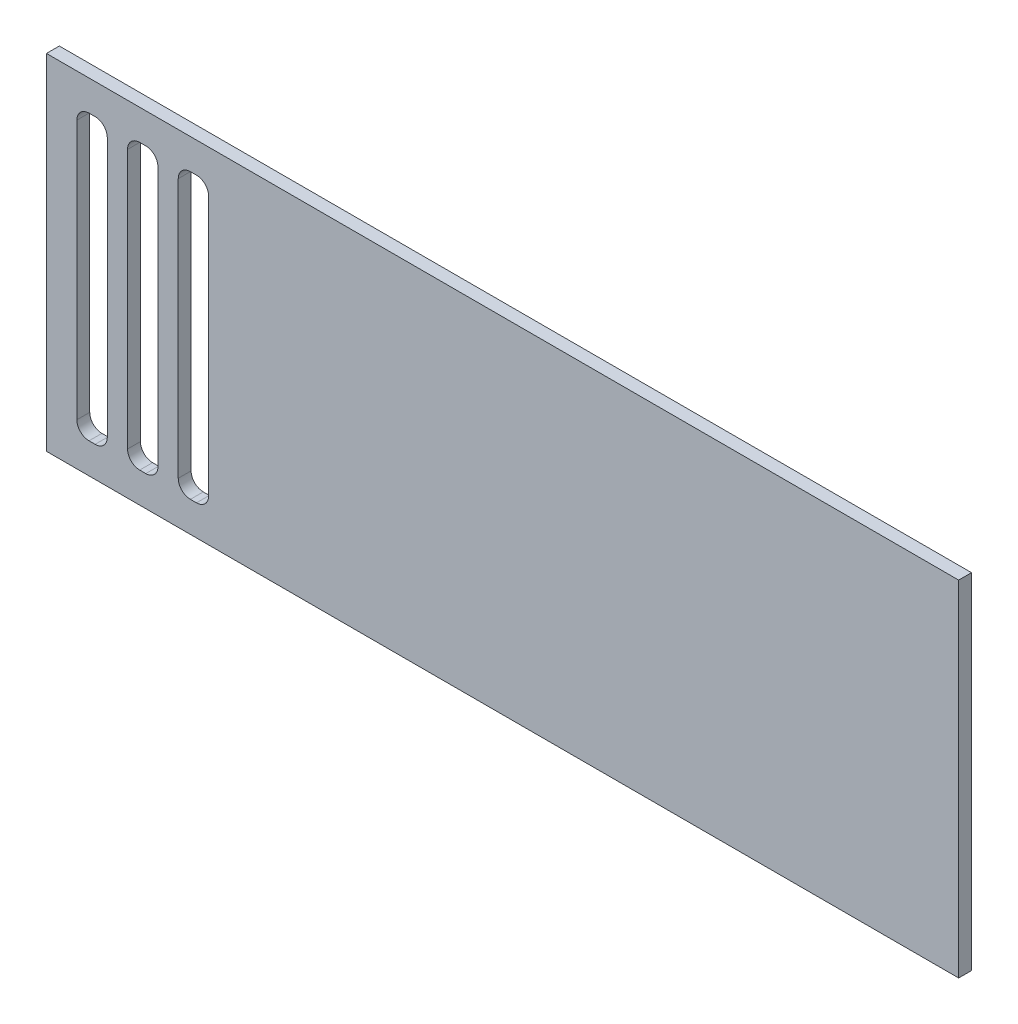
ISO-10303-21;
HEADER;
FILE_DESCRIPTION(('STEP AP214'),'2;1');
FILE_NAME('part.step','',(''),(''),'','','');
FILE_SCHEMA(('AUTOMOTIVE_DESIGN { 1 0 10303 214 1 1 1 1 }'));
ENDSEC;
DATA;
#1=APPLICATION_CONTEXT('core data for automotive mechanical design processes');
#2=APPLICATION_PROTOCOL_DEFINITION('international standard','automotive_design',2000,#1);
#3=PRODUCT_CONTEXT('',#1,'mechanical');
#4=PRODUCT('Part','Part','',(#3));
#5=PRODUCT_RELATED_PRODUCT_CATEGORY('part','',(#4));
#6=PRODUCT_DEFINITION_FORMATION('','',#4);
#7=PRODUCT_DEFINITION_CONTEXT('part definition',#1,'design');
#8=PRODUCT_DEFINITION('design','',#6,#7);
#9=PRODUCT_DEFINITION_SHAPE('','',#8);
#10=(LENGTH_UNIT() NAMED_UNIT(*) SI_UNIT(.MILLI.,.METRE.));
#11=(NAMED_UNIT(*) PLANE_ANGLE_UNIT() SI_UNIT($,.RADIAN.));
#12=(NAMED_UNIT(*) SI_UNIT($,.STERADIAN.) SOLID_ANGLE_UNIT());
#13=UNCERTAINTY_MEASURE_WITH_UNIT(LENGTH_MEASURE(1.E-05),#10,'distance_accuracy_value','');
#14=(GEOMETRIC_REPRESENTATION_CONTEXT(3) GLOBAL_UNCERTAINTY_ASSIGNED_CONTEXT((#13)) GLOBAL_UNIT_ASSIGNED_CONTEXT((#10,
#11,#12)) REPRESENTATION_CONTEXT('',''));
#15=CARTESIAN_POINT('',(0.,0.,0.));
#16=DIRECTION('',(0.,0.,1.));
#17=DIRECTION('',(1.,0.,0.));
#18=AXIS2_PLACEMENT_3D('',#15,#16,#17);
#19=CARTESIAN_POINT('',(0.,0.,6.35));
#20=DIRECTION('',(1.,0.,0.));
#21=DIRECTION('',(0.,0.,-1.));
#22=AXIS2_PLACEMENT_3D('',#19,#20,#21);
#23=PLANE('',#22);
#24=DIRECTION('',(0.,-1.,0.));
#25=VECTOR('',#24,1.);
#26=CARTESIAN_POINT('',(0.,0.,0.));
#27=LINE('',#26,#25);
#28=CARTESIAN_POINT('',(0.,170.,0.));
#29=VERTEX_POINT('',#28);
#30=CARTESIAN_POINT('',(0.,0.,0.));
#31=VERTEX_POINT('',#30);
#32=EDGE_CURVE('E258',#29,#31,#27,.T.);
#33=ORIENTED_EDGE('',*,*,#32,.T.);
#34=DIRECTION('',(0.,0.,-1.));
#35=VECTOR('',#34,1.);
#36=CARTESIAN_POINT('',(0.,0.,6.35));
#37=LINE('',#36,#35);
#38=CARTESIAN_POINT('',(0.,0.,6.35));
#39=VERTEX_POINT('',#38);
#40=EDGE_CURVE('E237',#39,#31,#37,.T.);
#41=ORIENTED_EDGE('',*,*,#40,.F.);
#42=DIRECTION('',(0.,-1.,0.));
#43=VECTOR('',#42,1.);
#44=CARTESIAN_POINT('',(0.,0.,6.35));
#45=LINE('',#44,#43);
#46=CARTESIAN_POINT('',(0.,170.,6.35));
#47=VERTEX_POINT('',#46);
#48=EDGE_CURVE('E245',#47,#39,#45,.T.);
#49=ORIENTED_EDGE('',*,*,#48,.F.);
#50=DIRECTION('',(0.,0.,-1.));
#51=VECTOR('',#50,1.);
#52=CARTESIAN_POINT('',(0.,170.,6.35));
#53=LINE('',#52,#51);
#54=EDGE_CURVE('E487',#47,#29,#53,.T.);
#55=ORIENTED_EDGE('',*,*,#54,.T.);
#56=EDGE_LOOP('',(#33,#41,#49,#55));
#57=FACE_BOUND('',#56,.T.);
#58=ADVANCED_FACE('F48',(#57),#23,.F.);
#59=CARTESIAN_POINT('',(0.,0.,6.35));
#60=DIRECTION('',(0.,1.,0.));
#61=DIRECTION('',(0.,0.,1.));
#62=AXIS2_PLACEMENT_3D('',#59,#60,#61);
#63=PLANE('',#62);
#64=DIRECTION('',(1.,0.,0.));
#65=VECTOR('',#64,1.);
#66=CARTESIAN_POINT('',(0.,0.,0.));
#67=LINE('',#66,#65);
#68=CARTESIAN_POINT('',(450.,0.,0.));
#69=VERTEX_POINT('',#68);
#70=EDGE_CURVE('E490',#31,#69,#67,.T.);
#71=ORIENTED_EDGE('',*,*,#70,.T.);
#72=DIRECTION('',(0.,0.,-1.));
#73=VECTOR('',#72,1.);
#74=CARTESIAN_POINT('',(450.,0.,6.35));
#75=LINE('',#74,#73);
#76=CARTESIAN_POINT('',(450.,0.,6.35));
#77=VERTEX_POINT('',#76);
#78=EDGE_CURVE('E240',#77,#69,#75,.T.);
#79=ORIENTED_EDGE('',*,*,#78,.F.);
#80=DIRECTION('',(1.,0.,0.));
#81=VECTOR('',#80,1.);
#82=CARTESIAN_POINT('',(0.,0.,6.35));
#83=LINE('',#82,#81);
#84=EDGE_CURVE('E233',#39,#77,#83,.T.);
#85=ORIENTED_EDGE('',*,*,#84,.F.);
#86=ORIENTED_EDGE('',*,*,#40,.T.);
#87=EDGE_LOOP('',(#71,#79,#85,#86));
#88=FACE_BOUND('',#87,.T.);
#89=ADVANCED_FACE('F235',(#88),#63,.F.);
#90=CARTESIAN_POINT('',(450.,0.,6.35));
#91=DIRECTION('',(-1.,0.,0.));
#92=DIRECTION('',(0.,0.,1.));
#93=AXIS2_PLACEMENT_3D('',#90,#91,#92);
#94=PLANE('',#93);
#95=DIRECTION('',(0.,1.,0.));
#96=VECTOR('',#95,1.);
#97=CARTESIAN_POINT('',(450.,0.,0.));
#98=LINE('',#97,#96);
#99=CARTESIAN_POINT('',(450.,170.,0.));
#100=VERTEX_POINT('',#99);
#101=EDGE_CURVE('E493',#69,#100,#98,.T.);
#102=ORIENTED_EDGE('',*,*,#101,.T.);
#103=DIRECTION('',(0.,0.,-1.));
#104=VECTOR('',#103,1.);
#105=CARTESIAN_POINT('',(450.,170.,6.35));
#106=LINE('',#105,#104);
#107=CARTESIAN_POINT('',(450.,170.,6.35));
#108=VERTEX_POINT('',#107);
#109=EDGE_CURVE('E267',#108,#100,#106,.T.);
#110=ORIENTED_EDGE('',*,*,#109,.F.);
#111=DIRECTION('',(0.,1.,0.));
#112=VECTOR('',#111,1.);
#113=CARTESIAN_POINT('',(450.,0.,6.35));
#114=LINE('',#113,#112);
#115=EDGE_CURVE('E244',#77,#108,#114,.T.);
#116=ORIENTED_EDGE('',*,*,#115,.F.);
#117=ORIENTED_EDGE('',*,*,#78,.T.);
#118=EDGE_LOOP('',(#102,#110,#116,#117));
#119=FACE_BOUND('',#118,.T.);
#120=ADVANCED_FACE('F508',(#119),#94,.F.);
#121=CARTESIAN_POINT('',(0.,170.,6.35));
#122=DIRECTION('',(0.,-1.,0.));
#123=DIRECTION('',(0.,0.,-1.));
#124=AXIS2_PLACEMENT_3D('',#121,#122,#123);
#125=PLANE('',#124);
#126=DIRECTION('',(-1.,0.,0.));
#127=VECTOR('',#126,1.);
#128=CARTESIAN_POINT('',(0.,170.,0.));
#129=LINE('',#128,#127);
#130=EDGE_CURVE('E255',#100,#29,#129,.T.);
#131=ORIENTED_EDGE('',*,*,#130,.T.);
#132=ORIENTED_EDGE('',*,*,#54,.F.);
#133=DIRECTION('',(-1.,0.,0.));
#134=VECTOR('',#133,1.);
#135=CARTESIAN_POINT('',(0.,170.,6.35));
#136=LINE('',#135,#134);
#137=EDGE_CURVE('E250',#108,#47,#136,.T.);
#138=ORIENTED_EDGE('',*,*,#137,.F.);
#139=ORIENTED_EDGE('',*,*,#109,.T.);
#140=EDGE_LOOP('',(#131,#132,#138,#139));
#141=FACE_BOUND('',#140,.T.);
#142=ADVANCED_FACE('F504',(#141),#125,.F.);
#143=CARTESIAN_POINT('',(0.,0.,6.35));
#144=DIRECTION('',(0.,0.,-1.));
#145=DIRECTION('',(-1.,0.,0.));
#146=AXIS2_PLACEMENT_3D('',#143,#144,#145);
#147=PLANE('',#146);
#148=DIRECTION('',(-1.,0.,0.));
#149=VECTOR('',#148,1.);
#150=CARTESIAN_POINT('',(0.,15.,6.35));
#151=LINE('',#150,#149);
#152=CARTESIAN_POINT('',(24.,15.,6.35));
#153=VERTEX_POINT('',#152);
#154=CARTESIAN_POINT('',(21.,15.,6.35));
#155=VERTEX_POINT('',#154);
#156=EDGE_CURVE('E472',#153,#155,#151,.T.);
#157=ORIENTED_EDGE('',*,*,#156,.T.);
#158=CARTESIAN_POINT('',(21.,21.,6.35));
#159=DIRECTION('',(0.,0.,-1.));
#160=DIRECTION('',(-1.,0.,0.));
#161=AXIS2_PLACEMENT_3D('',#158,#159,#160);
#162=CIRCLE('',#161,6.);
#163=CARTESIAN_POINT('',(15.,21.,6.35));
#164=VERTEX_POINT('',#163);
#165=EDGE_CURVE('E57',#155,#164,#162,.T.);
#166=ORIENTED_EDGE('',*,*,#165,.T.);
#167=DIRECTION('',(0.,1.,0.));
#168=VECTOR('',#167,1.);
#169=CARTESIAN_POINT('',(15.,0.,6.35));
#170=LINE('',#169,#168);
#171=CARTESIAN_POINT('',(15.,149.,6.35));
#172=VERTEX_POINT('',#171);
#173=EDGE_CURVE('E469',#164,#172,#170,.T.);
#174=ORIENTED_EDGE('',*,*,#173,.T.);
#175=CARTESIAN_POINT('',(21.,149.,6.35));
#176=DIRECTION('',(0.,0.,-1.));
#177=DIRECTION('',(-1.,0.,0.));
#178=AXIS2_PLACEMENT_3D('',#175,#176,#177);
#179=CIRCLE('',#178,6.);
#180=CARTESIAN_POINT('',(21.,155.,6.35));
#181=VERTEX_POINT('',#180);
#182=EDGE_CURVE('E311',#172,#181,#179,.T.);
#183=ORIENTED_EDGE('',*,*,#182,.T.);
#184=DIRECTION('',(1.,0.,0.));
#185=VECTOR('',#184,1.);
#186=CARTESIAN_POINT('',(0.,155.,6.35));
#187=LINE('',#186,#185);
#188=CARTESIAN_POINT('',(24.,155.,6.35));
#189=VERTEX_POINT('',#188);
#190=EDGE_CURVE('E479',#181,#189,#187,.T.);
#191=ORIENTED_EDGE('',*,*,#190,.T.);
#192=CARTESIAN_POINT('',(24.,149.,6.35));
#193=DIRECTION('',(0.,0.,-1.));
#194=DIRECTION('',(-1.,0.,0.));
#195=AXIS2_PLACEMENT_3D('',#192,#193,#194);
#196=CIRCLE('',#195,6.);
#197=CARTESIAN_POINT('',(30.,149.,6.35));
#198=VERTEX_POINT('',#197);
#199=EDGE_CURVE('E329',#189,#198,#196,.T.);
#200=ORIENTED_EDGE('',*,*,#199,.T.);
#201=DIRECTION('',(0.,-1.,0.));
#202=VECTOR('',#201,1.);
#203=CARTESIAN_POINT('',(30.,0.,6.35));
#204=LINE('',#203,#202);
#205=CARTESIAN_POINT('',(30.,21.,6.35));
#206=VERTEX_POINT('',#205);
#207=EDGE_CURVE('E475',#198,#206,#204,.T.);
#208=ORIENTED_EDGE('',*,*,#207,.T.);
#209=CARTESIAN_POINT('',(24.,21.,6.35));
#210=DIRECTION('',(0.,0.,-1.));
#211=DIRECTION('',(-1.,0.,0.));
#212=AXIS2_PLACEMENT_3D('',#209,#210,#211);
#213=CIRCLE('',#212,6.);
#214=EDGE_CURVE('E388',#206,#153,#213,.T.);
#215=ORIENTED_EDGE('',*,*,#214,.T.);
#216=EDGE_LOOP('',(#157,#166,#174,#183,#191,#200,#208,#215));
#217=FACE_BOUND('',#216,.T.);
#218=DIRECTION('',(-1.,0.,0.));
#219=VECTOR('',#218,1.);
#220=CARTESIAN_POINT('',(0.,15.,6.35));
#221=LINE('',#220,#219);
#222=CARTESIAN_POINT('',(49.,15.,6.35));
#223=VERTEX_POINT('',#222);
#224=CARTESIAN_POINT('',(46.,15.,6.35));
#225=VERTEX_POINT('',#224);
#226=EDGE_CURVE('E446',#223,#225,#221,.T.);
#227=ORIENTED_EDGE('',*,*,#226,.T.);
#228=CARTESIAN_POINT('',(46.,21.,6.35));
#229=DIRECTION('',(0.,0.,-1.));
#230=DIRECTION('',(-1.,0.,0.));
#231=AXIS2_PLACEMENT_3D('',#228,#229,#230);
#232=CIRCLE('',#231,6.);
#233=CARTESIAN_POINT('',(40.,21.,6.35));
#234=VERTEX_POINT('',#233);
#235=EDGE_CURVE('E412',#225,#234,#232,.T.);
#236=ORIENTED_EDGE('',*,*,#235,.T.);
#237=DIRECTION('',(0.,1.,0.));
#238=VECTOR('',#237,1.);
#239=CARTESIAN_POINT('',(40.,0.,6.35));
#240=LINE('',#239,#238);
#241=CARTESIAN_POINT('',(40.,149.,6.35));
#242=VERTEX_POINT('',#241);
#243=EDGE_CURVE('E444',#234,#242,#240,.T.);
#244=ORIENTED_EDGE('',*,*,#243,.T.);
#245=CARTESIAN_POINT('',(46.,149.,6.35));
#246=DIRECTION('',(0.,0.,-1.));
#247=DIRECTION('',(-1.,0.,0.));
#248=AXIS2_PLACEMENT_3D('',#245,#246,#247);
#249=CIRCLE('',#248,6.);
#250=CARTESIAN_POINT('',(46.,155.,6.35));
#251=VERTEX_POINT('',#250);
#252=EDGE_CURVE('E317',#242,#251,#249,.T.);
#253=ORIENTED_EDGE('',*,*,#252,.T.);
#254=DIRECTION('',(1.,0.,0.));
#255=VECTOR('',#254,1.);
#256=CARTESIAN_POINT('',(0.,155.,6.35));
#257=LINE('',#256,#255);
#258=CARTESIAN_POINT('',(49.,155.,6.35));
#259=VERTEX_POINT('',#258);
#260=EDGE_CURVE('E465',#251,#259,#257,.T.);
#261=ORIENTED_EDGE('',*,*,#260,.T.);
#262=CARTESIAN_POINT('',(49.,149.,6.35));
#263=DIRECTION('',(0.,0.,-1.));
#264=DIRECTION('',(-1.,0.,0.));
#265=AXIS2_PLACEMENT_3D('',#262,#263,#264);
#266=CIRCLE('',#265,6.);
#267=CARTESIAN_POINT('',(55.,149.,6.35));
#268=VERTEX_POINT('',#267);
#269=EDGE_CURVE('E335',#259,#268,#266,.T.);
#270=ORIENTED_EDGE('',*,*,#269,.T.);
#271=DIRECTION('',(0.,-1.,0.));
#272=VECTOR('',#271,1.);
#273=CARTESIAN_POINT('',(55.,0.,6.35));
#274=LINE('',#273,#272);
#275=CARTESIAN_POINT('',(55.,21.,6.35));
#276=VERTEX_POINT('',#275);
#277=EDGE_CURVE('E455',#268,#276,#274,.T.);
#278=ORIENTED_EDGE('',*,*,#277,.T.);
#279=CARTESIAN_POINT('',(49.,21.,6.35));
#280=DIRECTION('',(0.,0.,-1.));
#281=DIRECTION('',(-1.,0.,0.));
#282=AXIS2_PLACEMENT_3D('',#279,#280,#281);
#283=CIRCLE('',#282,6.);
#284=EDGE_CURVE('E394',#276,#223,#283,.T.);
#285=ORIENTED_EDGE('',*,*,#284,.T.);
#286=EDGE_LOOP('',(#227,#236,#244,#253,#261,#270,#278,#285));
#287=FACE_BOUND('',#286,.T.);
#288=DIRECTION('',(-1.,0.,0.));
#289=VECTOR('',#288,1.);
#290=CARTESIAN_POINT('',(0.,15.,6.35));
#291=LINE('',#290,#289);
#292=CARTESIAN_POINT('',(74.,15.,6.35));
#293=VERTEX_POINT('',#292);
#294=CARTESIAN_POINT('',(71.,15.,6.35));
#295=VERTEX_POINT('',#294);
#296=EDGE_CURVE('E458',#293,#295,#291,.T.);
#297=ORIENTED_EDGE('',*,*,#296,.T.);
#298=CARTESIAN_POINT('',(71.,21.,6.35));
#299=DIRECTION('',(0.,0.,-1.));
#300=DIRECTION('',(-1.,0.,0.));
#301=AXIS2_PLACEMENT_3D('',#298,#299,#300);
#302=CIRCLE('',#301,6.);
#303=CARTESIAN_POINT('',(65.,21.,6.35));
#304=VERTEX_POINT('',#303);
#305=EDGE_CURVE('E406',#295,#304,#302,.T.);
#306=ORIENTED_EDGE('',*,*,#305,.T.);
#307=DIRECTION('',(0.,1.,0.));
#308=VECTOR('',#307,1.);
#309=CARTESIAN_POINT('',(65.,0.,6.35));
#310=LINE('',#309,#308);
#311=CARTESIAN_POINT('',(65.,149.,6.35));
#312=VERTEX_POINT('',#311);
#313=EDGE_CURVE('E618',#304,#312,#310,.T.);
#314=ORIENTED_EDGE('',*,*,#313,.T.);
#315=CARTESIAN_POINT('',(71.,149.,6.35));
#316=DIRECTION('',(0.,0.,-1.));
#317=DIRECTION('',(-1.,0.,0.));
#318=AXIS2_PLACEMENT_3D('',#315,#316,#317);
#319=CIRCLE('',#318,6.);
#320=CARTESIAN_POINT('',(71.,155.,6.35));
#321=VERTEX_POINT('',#320);
#322=EDGE_CURVE('E323',#312,#321,#319,.T.);
#323=ORIENTED_EDGE('',*,*,#322,.T.);
#324=DIRECTION('',(1.,0.,0.));
#325=VECTOR('',#324,1.);
#326=CARTESIAN_POINT('',(0.,155.,6.35));
#327=LINE('',#326,#325);
#328=CARTESIAN_POINT('',(74.,155.,6.35));
#329=VERTEX_POINT('',#328);
#330=EDGE_CURVE('E586',#321,#329,#327,.T.);
#331=ORIENTED_EDGE('',*,*,#330,.T.);
#332=CARTESIAN_POINT('',(74.,149.,6.35));
#333=DIRECTION('',(0.,0.,-1.));
#334=DIRECTION('',(-1.,0.,0.));
#335=AXIS2_PLACEMENT_3D('',#332,#333,#334);
#336=CIRCLE('',#335,6.);
#337=CARTESIAN_POINT('',(80.,149.,6.35));
#338=VERTEX_POINT('',#337);
#339=EDGE_CURVE('E341',#329,#338,#336,.T.);
#340=ORIENTED_EDGE('',*,*,#339,.T.);
#341=DIRECTION('',(0.,-1.,0.));
#342=VECTOR('',#341,1.);
#343=CARTESIAN_POINT('',(80.,0.,6.35));
#344=LINE('',#343,#342);
#345=CARTESIAN_POINT('',(80.,21.,6.35));
#346=VERTEX_POINT('',#345);
#347=EDGE_CURVE('E451',#338,#346,#344,.T.);
#348=ORIENTED_EDGE('',*,*,#347,.T.);
#349=CARTESIAN_POINT('',(74.,21.,6.35));
#350=DIRECTION('',(0.,0.,-1.));
#351=DIRECTION('',(-1.,0.,0.));
#352=AXIS2_PLACEMENT_3D('',#349,#350,#351);
#353=CIRCLE('',#352,6.);
#354=EDGE_CURVE('E400',#346,#293,#353,.T.);
#355=ORIENTED_EDGE('',*,*,#354,.T.);
#356=EDGE_LOOP('',(#297,#306,#314,#323,#331,#340,#348,#355));
#357=FACE_BOUND('',#356,.T.);
#358=ORIENTED_EDGE('',*,*,#48,.T.);
#359=ORIENTED_EDGE('',*,*,#84,.T.);
#360=ORIENTED_EDGE('',*,*,#115,.T.);
#361=ORIENTED_EDGE('',*,*,#137,.T.);
#362=EDGE_LOOP('',(#358,#359,#360,#361));
#363=FACE_BOUND('',#362,.T.);
#364=ADVANCED_FACE('F248',(#217,#287,#357,#363),#147,.F.);
#365=CARTESIAN_POINT('',(0.,0.,0.));
#366=DIRECTION('',(0.,0.,-1.));
#367=DIRECTION('',(-1.,0.,0.));
#368=AXIS2_PLACEMENT_3D('',#365,#366,#367);
#369=PLANE('',#368);
#370=DIRECTION('',(1.,0.,0.));
#371=VECTOR('',#370,1.);
#372=CARTESIAN_POINT('',(30.,15.,0.));
#373=LINE('',#372,#371);
#374=CARTESIAN_POINT('',(21.,15.,0.));
#375=VERTEX_POINT('',#374);
#376=CARTESIAN_POINT('',(24.,15.,0.));
#377=VERTEX_POINT('',#376);
#378=EDGE_CURVE('E574',#375,#377,#373,.T.);
#379=ORIENTED_EDGE('',*,*,#378,.T.);
#380=CARTESIAN_POINT('',(24.,21.,0.));
#381=DIRECTION('',(0.,0.,-1.));
#382=DIRECTION('',(-1.,0.,0.));
#383=AXIS2_PLACEMENT_3D('',#380,#381,#382);
#384=CIRCLE('',#383,6.);
#385=CARTESIAN_POINT('',(30.,21.,0.));
#386=VERTEX_POINT('',#385);
#387=EDGE_CURVE('E391',#377,#386,#384,.F.);
#388=ORIENTED_EDGE('',*,*,#387,.T.);
#389=DIRECTION('',(0.,1.,0.));
#390=VECTOR('',#389,1.);
#391=CARTESIAN_POINT('',(30.,155.,0.));
#392=LINE('',#391,#390);
#393=CARTESIAN_POINT('',(30.,149.,0.));
#394=VERTEX_POINT('',#393);
#395=EDGE_CURVE('E582',#386,#394,#392,.T.);
#396=ORIENTED_EDGE('',*,*,#395,.T.);
#397=CARTESIAN_POINT('',(24.,149.,0.));
#398=DIRECTION('',(0.,0.,-1.));
#399=DIRECTION('',(-1.,0.,0.));
#400=AXIS2_PLACEMENT_3D('',#397,#398,#399);
#401=CIRCLE('',#400,6.);
#402=CARTESIAN_POINT('',(24.,155.,0.));
#403=VERTEX_POINT('',#402);
#404=EDGE_CURVE('E332',#394,#403,#401,.F.);
#405=ORIENTED_EDGE('',*,*,#404,.T.);
#406=DIRECTION('',(-1.,0.,0.));
#407=VECTOR('',#406,1.);
#408=CARTESIAN_POINT('',(15.,155.,0.));
#409=LINE('',#408,#407);
#410=CARTESIAN_POINT('',(21.,155.,0.));
#411=VERTEX_POINT('',#410);
#412=EDGE_CURVE('E588',#403,#411,#409,.T.);
#413=ORIENTED_EDGE('',*,*,#412,.T.);
#414=CARTESIAN_POINT('',(21.,149.,0.));
#415=DIRECTION('',(0.,0.,-1.));
#416=DIRECTION('',(-1.,0.,0.));
#417=AXIS2_PLACEMENT_3D('',#414,#415,#416);
#418=CIRCLE('',#417,6.);
#419=CARTESIAN_POINT('',(15.,149.,0.));
#420=VERTEX_POINT('',#419);
#421=EDGE_CURVE('E314',#411,#420,#418,.F.);
#422=ORIENTED_EDGE('',*,*,#421,.T.);
#423=DIRECTION('',(0.,-1.,0.));
#424=VECTOR('',#423,1.);
#425=CARTESIAN_POINT('',(15.,15.,0.));
#426=LINE('',#425,#424);
#427=CARTESIAN_POINT('',(15.,21.,0.));
#428=VERTEX_POINT('',#427);
#429=EDGE_CURVE('E576',#420,#428,#426,.T.);
#430=ORIENTED_EDGE('',*,*,#429,.T.);
#431=CARTESIAN_POINT('',(21.,21.,0.));
#432=DIRECTION('',(0.,0.,-1.));
#433=DIRECTION('',(-1.,0.,0.));
#434=AXIS2_PLACEMENT_3D('',#431,#432,#433);
#435=CIRCLE('',#434,6.);
#436=EDGE_CURVE('E11',#428,#375,#435,.F.);
#437=ORIENTED_EDGE('',*,*,#436,.T.);
#438=EDGE_LOOP('',(#379,#388,#396,#405,#413,#422,#430,#437));
#439=FACE_BOUND('',#438,.T.);
#440=DIRECTION('',(1.,0.,0.));
#441=VECTOR('',#440,1.);
#442=CARTESIAN_POINT('',(55.,15.,0.));
#443=LINE('',#442,#441);
#444=CARTESIAN_POINT('',(46.,15.,0.));
#445=VERTEX_POINT('',#444);
#446=CARTESIAN_POINT('',(49.,15.,0.));
#447=VERTEX_POINT('',#446);
#448=EDGE_CURVE('E425',#445,#447,#443,.T.);
#449=ORIENTED_EDGE('',*,*,#448,.T.);
#450=CARTESIAN_POINT('',(49.,21.,0.));
#451=DIRECTION('',(0.,0.,-1.));
#452=DIRECTION('',(-1.,0.,0.));
#453=AXIS2_PLACEMENT_3D('',#450,#451,#452);
#454=CIRCLE('',#453,6.);
#455=CARTESIAN_POINT('',(55.,21.,0.));
#456=VERTEX_POINT('',#455);
#457=EDGE_CURVE('E397',#447,#456,#454,.F.);
#458=ORIENTED_EDGE('',*,*,#457,.T.);
#459=DIRECTION('',(0.,1.,0.));
#460=VECTOR('',#459,1.);
#461=CARTESIAN_POINT('',(55.,155.,0.));
#462=LINE('',#461,#460);
#463=CARTESIAN_POINT('',(55.,149.,0.));
#464=VERTEX_POINT('',#463);
#465=EDGE_CURVE('E438',#456,#464,#462,.T.);
#466=ORIENTED_EDGE('',*,*,#465,.T.);
#467=CARTESIAN_POINT('',(49.,149.,0.));
#468=DIRECTION('',(0.,0.,-1.));
#469=DIRECTION('',(-1.,0.,0.));
#470=AXIS2_PLACEMENT_3D('',#467,#468,#469);
#471=CIRCLE('',#470,6.);
#472=CARTESIAN_POINT('',(49.,155.,0.));
#473=VERTEX_POINT('',#472);
#474=EDGE_CURVE('E338',#464,#473,#471,.F.);
#475=ORIENTED_EDGE('',*,*,#474,.T.);
#476=DIRECTION('',(-1.,0.,0.));
#477=VECTOR('',#476,1.);
#478=CARTESIAN_POINT('',(40.,155.,0.));
#479=LINE('',#478,#477);
#480=CARTESIAN_POINT('',(46.,155.,0.));
#481=VERTEX_POINT('',#480);
#482=EDGE_CURVE('E597',#473,#481,#479,.T.);
#483=ORIENTED_EDGE('',*,*,#482,.T.);
#484=CARTESIAN_POINT('',(46.,149.,0.));
#485=DIRECTION('',(0.,0.,-1.));
#486=DIRECTION('',(-1.,0.,0.));
#487=AXIS2_PLACEMENT_3D('',#484,#485,#486);
#488=CIRCLE('',#487,6.);
#489=CARTESIAN_POINT('',(40.,149.,0.));
#490=VERTEX_POINT('',#489);
#491=EDGE_CURVE('E320',#481,#490,#488,.F.);
#492=ORIENTED_EDGE('',*,*,#491,.T.);
#493=DIRECTION('',(0.,-1.,0.));
#494=VECTOR('',#493,1.);
#495=CARTESIAN_POINT('',(40.,15.,0.));
#496=LINE('',#495,#494);
#497=CARTESIAN_POINT('',(40.,21.,0.));
#498=VERTEX_POINT('',#497);
#499=EDGE_CURVE('E428',#490,#498,#496,.T.);
#500=ORIENTED_EDGE('',*,*,#499,.T.);
#501=CARTESIAN_POINT('',(46.,21.,0.));
#502=DIRECTION('',(0.,0.,-1.));
#503=DIRECTION('',(-1.,0.,0.));
#504=AXIS2_PLACEMENT_3D('',#501,#502,#503);
#505=CIRCLE('',#504,6.);
#506=EDGE_CURVE('E415',#498,#445,#505,.F.);
#507=ORIENTED_EDGE('',*,*,#506,.T.);
#508=EDGE_LOOP('',(#449,#458,#466,#475,#483,#492,#500,#507));
#509=FACE_BOUND('',#508,.T.);
#510=DIRECTION('',(1.,0.,0.));
#511=VECTOR('',#510,1.);
#512=CARTESIAN_POINT('',(65.,15.,0.));
#513=LINE('',#512,#511);
#514=CARTESIAN_POINT('',(71.,15.,0.));
#515=VERTEX_POINT('',#514);
#516=CARTESIAN_POINT('',(74.,15.,0.));
#517=VERTEX_POINT('',#516);
#518=EDGE_CURVE('E601',#515,#517,#513,.T.);
#519=ORIENTED_EDGE('',*,*,#518,.T.);
#520=CARTESIAN_POINT('',(74.,21.,0.));
#521=DIRECTION('',(0.,0.,-1.));
#522=DIRECTION('',(-1.,0.,0.));
#523=AXIS2_PLACEMENT_3D('',#520,#521,#522);
#524=CIRCLE('',#523,6.);
#525=CARTESIAN_POINT('',(80.,21.,0.));
#526=VERTEX_POINT('',#525);
#527=EDGE_CURVE('E403',#517,#526,#524,.F.);
#528=ORIENTED_EDGE('',*,*,#527,.T.);
#529=DIRECTION('',(0.,1.,0.));
#530=VECTOR('',#529,1.);
#531=CARTESIAN_POINT('',(80.,15.,0.));
#532=LINE('',#531,#530);
#533=CARTESIAN_POINT('',(80.,149.,0.));
#534=VERTEX_POINT('',#533);
#535=EDGE_CURVE('E593',#526,#534,#532,.T.);
#536=ORIENTED_EDGE('',*,*,#535,.T.);
#537=CARTESIAN_POINT('',(74.,149.,0.));
#538=DIRECTION('',(0.,0.,-1.));
#539=DIRECTION('',(-1.,0.,0.));
#540=AXIS2_PLACEMENT_3D('',#537,#538,#539);
#541=CIRCLE('',#540,6.);
#542=CARTESIAN_POINT('',(74.,155.,0.));
#543=VERTEX_POINT('',#542);
#544=EDGE_CURVE('E344',#534,#543,#541,.F.);
#545=ORIENTED_EDGE('',*,*,#544,.T.);
#546=DIRECTION('',(-1.,0.,0.));
#547=VECTOR('',#546,1.);
#548=CARTESIAN_POINT('',(80.,155.,0.));
#549=LINE('',#548,#547);
#550=CARTESIAN_POINT('',(71.,155.,0.));
#551=VERTEX_POINT('',#550);
#552=EDGE_CURVE('E609',#543,#551,#549,.T.);
#553=ORIENTED_EDGE('',*,*,#552,.T.);
#554=CARTESIAN_POINT('',(71.,149.,0.));
#555=DIRECTION('',(0.,0.,-1.));
#556=DIRECTION('',(-1.,0.,0.));
#557=AXIS2_PLACEMENT_3D('',#554,#555,#556);
#558=CIRCLE('',#557,6.);
#559=CARTESIAN_POINT('',(65.,149.,0.));
#560=VERTEX_POINT('',#559);
#561=EDGE_CURVE('E326',#551,#560,#558,.F.);
#562=ORIENTED_EDGE('',*,*,#561,.T.);
#563=DIRECTION('',(0.,-1.,0.));
#564=VECTOR('',#563,1.);
#565=CARTESIAN_POINT('',(65.,155.,0.));
#566=LINE('',#565,#564);
#567=CARTESIAN_POINT('',(65.,21.,0.));
#568=VERTEX_POINT('',#567);
#569=EDGE_CURVE('E605',#560,#568,#566,.T.);
#570=ORIENTED_EDGE('',*,*,#569,.T.);
#571=CARTESIAN_POINT('',(71.,21.,0.));
#572=DIRECTION('',(0.,0.,-1.));
#573=DIRECTION('',(-1.,0.,0.));
#574=AXIS2_PLACEMENT_3D('',#571,#572,#573);
#575=CIRCLE('',#574,6.);
#576=EDGE_CURVE('E409',#568,#515,#575,.F.);
#577=ORIENTED_EDGE('',*,*,#576,.T.);
#578=EDGE_LOOP('',(#519,#528,#536,#545,#553,#562,#570,#577));
#579=FACE_BOUND('',#578,.T.);
#580=ORIENTED_EDGE('',*,*,#32,.F.);
#581=ORIENTED_EDGE('',*,*,#130,.F.);
#582=ORIENTED_EDGE('',*,*,#101,.F.);
#583=ORIENTED_EDGE('',*,*,#70,.F.);
#584=EDGE_LOOP('',(#580,#581,#582,#583));
#585=FACE_BOUND('',#584,.T.);
#586=ADVANCED_FACE('F423',(#439,#509,#579,#585),#369,.T.);
#587=CARTESIAN_POINT('',(80.,15.,0.));
#588=DIRECTION('',(1.,0.,0.));
#589=DIRECTION('',(0.,0.,-1.));
#590=AXIS2_PLACEMENT_3D('',#587,#588,#589);
#591=PLANE('',#590);
#592=ORIENTED_EDGE('',*,*,#535,.F.);
#593=DIRECTION('',(0.,0.,1.));
#594=VECTOR('',#593,1.);
#595=CARTESIAN_POINT('',(80.,21.,6.35));
#596=LINE('',#595,#594);
#597=EDGE_CURVE('E369',#526,#346,#596,.T.);
#598=ORIENTED_EDGE('',*,*,#597,.T.);
#599=ORIENTED_EDGE('',*,*,#347,.F.);
#600=DIRECTION('',(0.,0.,1.));
#601=VECTOR('',#600,1.);
#602=CARTESIAN_POINT('',(80.,149.,0.));
#603=LINE('',#602,#601);
#604=EDGE_CURVE('E307',#338,#534,#603,.F.);
#605=ORIENTED_EDGE('',*,*,#604,.T.);
#606=EDGE_LOOP('',(#592,#598,#599,#605));
#607=FACE_BOUND('',#606,.T.);
#608=ADVANCED_FACE('F633',(#607),#591,.F.);
#609=CARTESIAN_POINT('',(65.,15.,0.));
#610=DIRECTION('',(0.,-1.,0.));
#611=DIRECTION('',(0.,0.,-1.));
#612=AXIS2_PLACEMENT_3D('',#609,#610,#611);
#613=PLANE('',#612);
#614=ORIENTED_EDGE('',*,*,#296,.F.);
#615=DIRECTION('',(0.,0.,1.));
#616=VECTOR('',#615,1.);
#617=CARTESIAN_POINT('',(74.,15.,0.));
#618=LINE('',#617,#616);
#619=EDGE_CURVE('E377',#293,#517,#618,.F.);
#620=ORIENTED_EDGE('',*,*,#619,.T.);
#621=ORIENTED_EDGE('',*,*,#518,.F.);
#622=DIRECTION('',(0.,0.,1.));
#623=VECTOR('',#622,1.);
#624=CARTESIAN_POINT('',(71.,15.,6.35));
#625=LINE('',#624,#623);
#626=EDGE_CURVE('E373',#515,#295,#625,.T.);
#627=ORIENTED_EDGE('',*,*,#626,.T.);
#628=EDGE_LOOP('',(#614,#620,#621,#627));
#629=FACE_BOUND('',#628,.T.);
#630=ADVANCED_FACE('F626',(#629),#613,.F.);
#631=CARTESIAN_POINT('',(65.,155.,0.));
#632=DIRECTION('',(-1.,0.,0.));
#633=DIRECTION('',(0.,0.,1.));
#634=AXIS2_PLACEMENT_3D('',#631,#632,#633);
#635=PLANE('',#634);
#636=ORIENTED_EDGE('',*,*,#313,.F.);
#637=DIRECTION('',(0.,0.,1.));
#638=VECTOR('',#637,1.);
#639=CARTESIAN_POINT('',(65.,21.,0.));
#640=LINE('',#639,#638);
#641=EDGE_CURVE('E380',#304,#568,#640,.F.);
#642=ORIENTED_EDGE('',*,*,#641,.T.);
#643=ORIENTED_EDGE('',*,*,#569,.F.);
#644=DIRECTION('',(0.,0.,1.));
#645=VECTOR('',#644,1.);
#646=CARTESIAN_POINT('',(65.,149.,6.35));
#647=LINE('',#646,#645);
#648=EDGE_CURVE('E288',#560,#312,#647,.T.);
#649=ORIENTED_EDGE('',*,*,#648,.T.);
#650=EDGE_LOOP('',(#636,#642,#643,#649));
#651=FACE_BOUND('',#650,.T.);
#652=ADVANCED_FACE('F649',(#651),#635,.F.);
#653=CARTESIAN_POINT('',(80.,155.,0.));
#654=DIRECTION('',(0.,1.,0.));
#655=DIRECTION('',(0.,0.,1.));
#656=AXIS2_PLACEMENT_3D('',#653,#654,#655);
#657=PLANE('',#656);
#658=ORIENTED_EDGE('',*,*,#330,.F.);
#659=DIRECTION('',(0.,0.,1.));
#660=VECTOR('',#659,1.);
#661=CARTESIAN_POINT('',(71.,155.,0.));
#662=LINE('',#661,#660);
#663=EDGE_CURVE('E296',#321,#551,#662,.F.);
#664=ORIENTED_EDGE('',*,*,#663,.T.);
#665=ORIENTED_EDGE('',*,*,#552,.F.);
#666=DIRECTION('',(0.,0.,1.));
#667=VECTOR('',#666,1.);
#668=CARTESIAN_POINT('',(74.,155.,6.35));
#669=LINE('',#668,#667);
#670=EDGE_CURVE('E292',#543,#329,#669,.T.);
#671=ORIENTED_EDGE('',*,*,#670,.T.);
#672=EDGE_LOOP('',(#658,#664,#665,#671));
#673=FACE_BOUND('',#672,.T.);
#674=ADVANCED_FACE('F642',(#673),#657,.F.);
#675=CARTESIAN_POINT('',(40.,155.,0.));
#676=DIRECTION('',(0.,1.,0.));
#677=DIRECTION('',(0.,0.,1.));
#678=AXIS2_PLACEMENT_3D('',#675,#676,#677);
#679=PLANE('',#678);
#680=ORIENTED_EDGE('',*,*,#260,.F.);
#681=DIRECTION('',(0.,0.,1.));
#682=VECTOR('',#681,1.);
#683=CARTESIAN_POINT('',(46.,155.,0.));
#684=LINE('',#683,#682);
#685=EDGE_CURVE('E285',#251,#481,#684,.F.);
#686=ORIENTED_EDGE('',*,*,#685,.T.);
#687=ORIENTED_EDGE('',*,*,#482,.F.);
#688=DIRECTION('',(0.,0.,1.));
#689=VECTOR('',#688,1.);
#690=CARTESIAN_POINT('',(49.,155.,6.35));
#691=LINE('',#690,#689);
#692=EDGE_CURVE('E281',#473,#259,#691,.T.);
#693=ORIENTED_EDGE('',*,*,#692,.T.);
#694=EDGE_LOOP('',(#680,#686,#687,#693));
#695=FACE_BOUND('',#694,.T.);
#696=ADVANCED_FACE('F658',(#695),#679,.F.);
#697=CARTESIAN_POINT('',(55.,155.,0.));
#698=DIRECTION('',(1.,0.,0.));
#699=DIRECTION('',(0.,0.,-1.));
#700=AXIS2_PLACEMENT_3D('',#697,#698,#699);
#701=PLANE('',#700);
#702=ORIENTED_EDGE('',*,*,#465,.F.);
#703=DIRECTION('',(0.,0.,1.));
#704=VECTOR('',#703,1.);
#705=CARTESIAN_POINT('',(55.,21.,6.35));
#706=LINE('',#705,#704);
#707=EDGE_CURVE('E358',#456,#276,#706,.T.);
#708=ORIENTED_EDGE('',*,*,#707,.T.);
#709=ORIENTED_EDGE('',*,*,#277,.F.);
#710=DIRECTION('',(0.,0.,1.));
#711=VECTOR('',#710,1.);
#712=CARTESIAN_POINT('',(55.,149.,0.));
#713=LINE('',#712,#711);
#714=EDGE_CURVE('E303',#268,#464,#713,.F.);
#715=ORIENTED_EDGE('',*,*,#714,.T.);
#716=EDGE_LOOP('',(#702,#708,#709,#715));
#717=FACE_BOUND('',#716,.T.);
#718=ADVANCED_FACE('F672',(#717),#701,.F.);
#719=CARTESIAN_POINT('',(55.,15.,0.));
#720=DIRECTION('',(0.,-1.,0.));
#721=DIRECTION('',(0.,0.,-1.));
#722=AXIS2_PLACEMENT_3D('',#719,#720,#721);
#723=PLANE('',#722);
#724=ORIENTED_EDGE('',*,*,#226,.F.);
#725=DIRECTION('',(0.,0.,1.));
#726=VECTOR('',#725,1.);
#727=CARTESIAN_POINT('',(49.,15.,0.));
#728=LINE('',#727,#726);
#729=EDGE_CURVE('E366',#223,#447,#728,.F.);
#730=ORIENTED_EDGE('',*,*,#729,.T.);
#731=ORIENTED_EDGE('',*,*,#448,.F.);
#732=DIRECTION('',(0.,0.,1.));
#733=VECTOR('',#732,1.);
#734=CARTESIAN_POINT('',(46.,15.,6.35));
#735=LINE('',#734,#733);
#736=EDGE_CURVE('E362',#445,#225,#735,.T.);
#737=ORIENTED_EDGE('',*,*,#736,.T.);
#738=EDGE_LOOP('',(#724,#730,#731,#737));
#739=FACE_BOUND('',#738,.T.);
#740=ADVANCED_FACE('F434',(#739),#723,.F.);
#741=CARTESIAN_POINT('',(40.,15.,0.));
#742=DIRECTION('',(-1.,0.,0.));
#743=DIRECTION('',(0.,0.,1.));
#744=AXIS2_PLACEMENT_3D('',#741,#742,#743);
#745=PLANE('',#744);
#746=ORIENTED_EDGE('',*,*,#243,.F.);
#747=DIRECTION('',(0.,0.,1.));
#748=VECTOR('',#747,1.);
#749=CARTESIAN_POINT('',(40.,21.,0.));
#750=LINE('',#749,#748);
#751=EDGE_CURVE('E383',#234,#498,#750,.F.);
#752=ORIENTED_EDGE('',*,*,#751,.T.);
#753=ORIENTED_EDGE('',*,*,#499,.F.);
#754=DIRECTION('',(0.,0.,1.));
#755=VECTOR('',#754,1.);
#756=CARTESIAN_POINT('',(40.,149.,6.35));
#757=LINE('',#756,#755);
#758=EDGE_CURVE('E277',#490,#242,#757,.T.);
#759=ORIENTED_EDGE('',*,*,#758,.T.);
#760=EDGE_LOOP('',(#746,#752,#753,#759));
#761=FACE_BOUND('',#760,.T.);
#762=ADVANCED_FACE('F448',(#761),#745,.F.);
#763=CARTESIAN_POINT('',(15.,155.,0.));
#764=DIRECTION('',(0.,1.,0.));
#765=DIRECTION('',(0.,0.,1.));
#766=AXIS2_PLACEMENT_3D('',#763,#764,#765);
#767=PLANE('',#766);
#768=ORIENTED_EDGE('',*,*,#190,.F.);
#769=DIRECTION('',(0.,0.,1.));
#770=VECTOR('',#769,1.);
#771=CARTESIAN_POINT('',(21.,155.,0.));
#772=LINE('',#771,#770);
#773=EDGE_CURVE('E274',#181,#411,#772,.F.);
#774=ORIENTED_EDGE('',*,*,#773,.T.);
#775=ORIENTED_EDGE('',*,*,#412,.F.);
#776=DIRECTION('',(0.,0.,1.));
#777=VECTOR('',#776,1.);
#778=CARTESIAN_POINT('',(24.,155.,6.35));
#779=LINE('',#778,#777);
#780=EDGE_CURVE('E265',#403,#189,#779,.T.);
#781=ORIENTED_EDGE('',*,*,#780,.T.);
#782=EDGE_LOOP('',(#768,#774,#775,#781));
#783=FACE_BOUND('',#782,.T.);
#784=ADVANCED_FACE('F679',(#783),#767,.F.);
#785=CARTESIAN_POINT('',(30.,155.,0.));
#786=DIRECTION('',(1.,0.,0.));
#787=DIRECTION('',(0.,0.,-1.));
#788=AXIS2_PLACEMENT_3D('',#785,#786,#787);
#789=PLANE('',#788);
#790=ORIENTED_EDGE('',*,*,#395,.F.);
#791=DIRECTION('',(0.,0.,1.));
#792=VECTOR('',#791,1.);
#793=CARTESIAN_POINT('',(30.,21.,6.35));
#794=LINE('',#793,#792);
#795=EDGE_CURVE('E347',#386,#206,#794,.T.);
#796=ORIENTED_EDGE('',*,*,#795,.T.);
#797=ORIENTED_EDGE('',*,*,#207,.F.);
#798=DIRECTION('',(0.,0.,1.));
#799=VECTOR('',#798,1.);
#800=CARTESIAN_POINT('',(30.,149.,0.));
#801=LINE('',#800,#799);
#802=EDGE_CURVE('E299',#198,#394,#801,.F.);
#803=ORIENTED_EDGE('',*,*,#802,.T.);
#804=EDGE_LOOP('',(#790,#796,#797,#803));
#805=FACE_BOUND('',#804,.T.);
#806=ADVANCED_FACE('F685',(#805),#789,.F.);
#807=CARTESIAN_POINT('',(30.,15.,0.));
#808=DIRECTION('',(0.,-1.,0.));
#809=DIRECTION('',(0.,0.,-1.));
#810=AXIS2_PLACEMENT_3D('',#807,#808,#809);
#811=PLANE('',#810);
#812=ORIENTED_EDGE('',*,*,#156,.F.);
#813=DIRECTION('',(0.,0.,1.));
#814=VECTOR('',#813,1.);
#815=CARTESIAN_POINT('',(24.,15.,0.));
#816=LINE('',#815,#814);
#817=EDGE_CURVE('E355',#153,#377,#816,.F.);
#818=ORIENTED_EDGE('',*,*,#817,.T.);
#819=ORIENTED_EDGE('',*,*,#378,.F.);
#820=DIRECTION('',(0.,0.,1.));
#821=VECTOR('',#820,1.);
#822=CARTESIAN_POINT('',(21.,15.,6.35));
#823=LINE('',#822,#821);
#824=EDGE_CURVE('E351',#375,#155,#823,.T.);
#825=ORIENTED_EDGE('',*,*,#824,.T.);
#826=EDGE_LOOP('',(#812,#818,#819,#825));
#827=FACE_BOUND('',#826,.T.);
#828=ADVANCED_FACE('F579',(#827),#811,.F.);
#829=CARTESIAN_POINT('',(15.,15.,0.));
#830=DIRECTION('',(-1.,0.,0.));
#831=DIRECTION('',(0.,0.,1.));
#832=AXIS2_PLACEMENT_3D('',#829,#830,#831);
#833=PLANE('',#832);
#834=ORIENTED_EDGE('',*,*,#173,.F.);
#835=DIRECTION('',(0.,0.,1.));
#836=VECTOR('',#835,1.);
#837=CARTESIAN_POINT('',(15.,21.,0.));
#838=LINE('',#837,#836);
#839=EDGE_CURVE('E70',#164,#428,#838,.F.);
#840=ORIENTED_EDGE('',*,*,#839,.T.);
#841=ORIENTED_EDGE('',*,*,#429,.F.);
#842=DIRECTION('',(0.,0.,1.));
#843=VECTOR('',#842,1.);
#844=CARTESIAN_POINT('',(15.,149.,6.35));
#845=LINE('',#844,#843);
#846=EDGE_CURVE('E260',#420,#172,#845,.T.);
#847=ORIENTED_EDGE('',*,*,#846,.T.);
#848=EDGE_LOOP('',(#834,#840,#841,#847));
#849=FACE_BOUND('',#848,.T.);
#850=ADVANCED_FACE('F526',(#849),#833,.F.);
#851=CARTESIAN_POINT('',(21.,149.,0.));
#852=DIRECTION('',(0.,0.,-1.));
#853=DIRECTION('',(-1.,0.,0.));
#854=AXIS2_PLACEMENT_3D('',#851,#852,#853);
#855=CYLINDRICAL_SURFACE('',#854,6.);
#856=ORIENTED_EDGE('',*,*,#421,.F.);
#857=ORIENTED_EDGE('',*,*,#773,.F.);
#858=ORIENTED_EDGE('',*,*,#182,.F.);
#859=ORIENTED_EDGE('',*,*,#846,.F.);
#860=EDGE_LOOP('',(#856,#857,#858,#859));
#861=FACE_BOUND('',#860,.T.);
#862=ADVANCED_FACE('F522',(#861),#855,.F.);
#863=CARTESIAN_POINT('',(46.,149.,0.));
#864=DIRECTION('',(0.,0.,-1.));
#865=DIRECTION('',(-1.,0.,0.));
#866=AXIS2_PLACEMENT_3D('',#863,#864,#865);
#867=CYLINDRICAL_SURFACE('',#866,6.);
#868=ORIENTED_EDGE('',*,*,#491,.F.);
#869=ORIENTED_EDGE('',*,*,#685,.F.);
#870=ORIENTED_EDGE('',*,*,#252,.F.);
#871=ORIENTED_EDGE('',*,*,#758,.F.);
#872=EDGE_LOOP('',(#868,#869,#870,#871));
#873=FACE_BOUND('',#872,.T.);
#874=ADVANCED_FACE('F525',(#873),#867,.F.);
#875=CARTESIAN_POINT('',(71.,149.,0.));
#876=DIRECTION('',(0.,0.,-1.));
#877=DIRECTION('',(-1.,0.,0.));
#878=AXIS2_PLACEMENT_3D('',#875,#876,#877);
#879=CYLINDRICAL_SURFACE('',#878,6.);
#880=ORIENTED_EDGE('',*,*,#561,.F.);
#881=ORIENTED_EDGE('',*,*,#663,.F.);
#882=ORIENTED_EDGE('',*,*,#322,.F.);
#883=ORIENTED_EDGE('',*,*,#648,.F.);
#884=EDGE_LOOP('',(#880,#881,#882,#883));
#885=FACE_BOUND('',#884,.T.);
#886=ADVANCED_FACE('F530',(#885),#879,.F.);
#887=CARTESIAN_POINT('',(24.,149.,0.));
#888=DIRECTION('',(0.,0.,-1.));
#889=DIRECTION('',(-1.,0.,0.));
#890=AXIS2_PLACEMENT_3D('',#887,#888,#889);
#891=CYLINDRICAL_SURFACE('',#890,6.);
#892=ORIENTED_EDGE('',*,*,#404,.F.);
#893=ORIENTED_EDGE('',*,*,#802,.F.);
#894=ORIENTED_EDGE('',*,*,#199,.F.);
#895=ORIENTED_EDGE('',*,*,#780,.F.);
#896=EDGE_LOOP('',(#892,#893,#894,#895));
#897=FACE_BOUND('',#896,.T.);
#898=ADVANCED_FACE('F534',(#897),#891,.F.);
#899=CARTESIAN_POINT('',(49.,149.,0.));
#900=DIRECTION('',(0.,0.,-1.));
#901=DIRECTION('',(-1.,0.,0.));
#902=AXIS2_PLACEMENT_3D('',#899,#900,#901);
#903=CYLINDRICAL_SURFACE('',#902,6.);
#904=ORIENTED_EDGE('',*,*,#474,.F.);
#905=ORIENTED_EDGE('',*,*,#714,.F.);
#906=ORIENTED_EDGE('',*,*,#269,.F.);
#907=ORIENTED_EDGE('',*,*,#692,.F.);
#908=EDGE_LOOP('',(#904,#905,#906,#907));
#909=FACE_BOUND('',#908,.T.);
#910=ADVANCED_FACE('F538',(#909),#903,.F.);
#911=CARTESIAN_POINT('',(74.,149.,0.));
#912=DIRECTION('',(0.,0.,-1.));
#913=DIRECTION('',(-1.,0.,0.));
#914=AXIS2_PLACEMENT_3D('',#911,#912,#913);
#915=CYLINDRICAL_SURFACE('',#914,6.);
#916=ORIENTED_EDGE('',*,*,#544,.F.);
#917=ORIENTED_EDGE('',*,*,#604,.F.);
#918=ORIENTED_EDGE('',*,*,#339,.F.);
#919=ORIENTED_EDGE('',*,*,#670,.F.);
#920=EDGE_LOOP('',(#916,#917,#918,#919));
#921=FACE_BOUND('',#920,.T.);
#922=ADVANCED_FACE('F542',(#921),#915,.F.);
#923=CARTESIAN_POINT('',(24.,21.,0.));
#924=DIRECTION('',(0.,0.,-1.));
#925=DIRECTION('',(-1.,0.,0.));
#926=AXIS2_PLACEMENT_3D('',#923,#924,#925);
#927=CYLINDRICAL_SURFACE('',#926,6.);
#928=ORIENTED_EDGE('',*,*,#387,.F.);
#929=ORIENTED_EDGE('',*,*,#817,.F.);
#930=ORIENTED_EDGE('',*,*,#214,.F.);
#931=ORIENTED_EDGE('',*,*,#795,.F.);
#932=EDGE_LOOP('',(#928,#929,#930,#931));
#933=FACE_BOUND('',#932,.T.);
#934=ADVANCED_FACE('F546',(#933),#927,.F.);
#935=CARTESIAN_POINT('',(49.,21.,0.));
#936=DIRECTION('',(0.,0.,-1.));
#937=DIRECTION('',(-1.,0.,0.));
#938=AXIS2_PLACEMENT_3D('',#935,#936,#937);
#939=CYLINDRICAL_SURFACE('',#938,6.);
#940=ORIENTED_EDGE('',*,*,#457,.F.);
#941=ORIENTED_EDGE('',*,*,#729,.F.);
#942=ORIENTED_EDGE('',*,*,#284,.F.);
#943=ORIENTED_EDGE('',*,*,#707,.F.);
#944=EDGE_LOOP('',(#940,#941,#942,#943));
#945=FACE_BOUND('',#944,.T.);
#946=ADVANCED_FACE('F550',(#945),#939,.F.);
#947=CARTESIAN_POINT('',(74.,21.,0.));
#948=DIRECTION('',(0.,0.,-1.));
#949=DIRECTION('',(-1.,0.,0.));
#950=AXIS2_PLACEMENT_3D('',#947,#948,#949);
#951=CYLINDRICAL_SURFACE('',#950,6.);
#952=ORIENTED_EDGE('',*,*,#527,.F.);
#953=ORIENTED_EDGE('',*,*,#619,.F.);
#954=ORIENTED_EDGE('',*,*,#354,.F.);
#955=ORIENTED_EDGE('',*,*,#597,.F.);
#956=EDGE_LOOP('',(#952,#953,#954,#955));
#957=FACE_BOUND('',#956,.T.);
#958=ADVANCED_FACE('F554',(#957),#951,.F.);
#959=CARTESIAN_POINT('',(71.,21.,0.));
#960=DIRECTION('',(0.,0.,-1.));
#961=DIRECTION('',(-1.,0.,0.));
#962=AXIS2_PLACEMENT_3D('',#959,#960,#961);
#963=CYLINDRICAL_SURFACE('',#962,6.);
#964=ORIENTED_EDGE('',*,*,#576,.F.);
#965=ORIENTED_EDGE('',*,*,#641,.F.);
#966=ORIENTED_EDGE('',*,*,#305,.F.);
#967=ORIENTED_EDGE('',*,*,#626,.F.);
#968=EDGE_LOOP('',(#964,#965,#966,#967));
#969=FACE_BOUND('',#968,.T.);
#970=ADVANCED_FACE('F558',(#969),#963,.F.);
#971=CARTESIAN_POINT('',(46.,21.,0.));
#972=DIRECTION('',(0.,0.,-1.));
#973=DIRECTION('',(-1.,0.,0.));
#974=AXIS2_PLACEMENT_3D('',#971,#972,#973);
#975=CYLINDRICAL_SURFACE('',#974,6.);
#976=ORIENTED_EDGE('',*,*,#506,.F.);
#977=ORIENTED_EDGE('',*,*,#751,.F.);
#978=ORIENTED_EDGE('',*,*,#235,.F.);
#979=ORIENTED_EDGE('',*,*,#736,.F.);
#980=EDGE_LOOP('',(#976,#977,#978,#979));
#981=FACE_BOUND('',#980,.T.);
#982=ADVANCED_FACE('F440',(#981),#975,.F.);
#983=CARTESIAN_POINT('',(21.,21.,0.));
#984=DIRECTION('',(0.,0.,-1.));
#985=DIRECTION('',(-1.,0.,0.));
#986=AXIS2_PLACEMENT_3D('',#983,#984,#985);
#987=CYLINDRICAL_SURFACE('',#986,6.);
#988=ORIENTED_EDGE('',*,*,#436,.F.);
#989=ORIENTED_EDGE('',*,*,#839,.F.);
#990=ORIENTED_EDGE('',*,*,#165,.F.);
#991=ORIENTED_EDGE('',*,*,#824,.F.);
#992=EDGE_LOOP('',(#988,#989,#990,#991));
#993=FACE_BOUND('',#992,.T.);
#994=ADVANCED_FACE('F50',(#993),#987,.F.);
#995=CLOSED_SHELL('',(#58,#89,#120,#142,#364,#586,#608,#630,#652,#674,#696,#718,#740,#762,#784,
#806,#828,#850,#862,#874,#886,#898,#910,#922,#934,#946,#958,#970,#982,#994));
#996=MANIFOLD_SOLID_BREP('B2',#995);
#997=ADVANCED_BREP_SHAPE_REPRESENTATION('',(#18,#996),#14);
#998=SHAPE_DEFINITION_REPRESENTATION(#9,#997);
ENDSEC;
END-ISO-10303-21;
